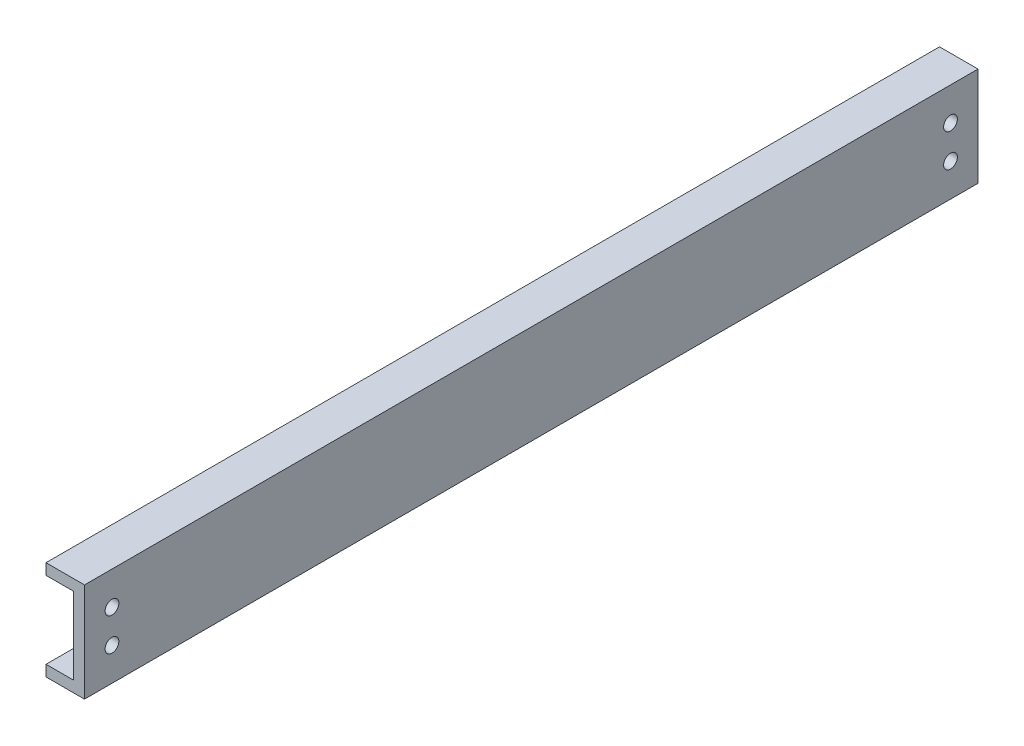
ISO-10303-21;
HEADER;
FILE_DESCRIPTION(('STEP AP214'),'2;1');
FILE_NAME('part.step','',(''),(''),'','','');
FILE_SCHEMA(('AUTOMOTIVE_DESIGN { 1 0 10303 214 1 1 1 1 }'));
ENDSEC;
DATA;
#1=APPLICATION_CONTEXT('core data for automotive mechanical design processes');
#2=APPLICATION_PROTOCOL_DEFINITION('international standard','automotive_design',2000,#1);
#3=PRODUCT_CONTEXT('',#1,'mechanical');
#4=PRODUCT('Part','Part','',(#3));
#5=PRODUCT_RELATED_PRODUCT_CATEGORY('part','',(#4));
#6=PRODUCT_DEFINITION_FORMATION('','',#4);
#7=PRODUCT_DEFINITION_CONTEXT('part definition',#1,'design');
#8=PRODUCT_DEFINITION('design','',#6,#7);
#9=PRODUCT_DEFINITION_SHAPE('','',#8);
#10=(LENGTH_UNIT() NAMED_UNIT(*) SI_UNIT(.MILLI.,.METRE.));
#11=(NAMED_UNIT(*) PLANE_ANGLE_UNIT() SI_UNIT($,.RADIAN.));
#12=(NAMED_UNIT(*) SI_UNIT($,.STERADIAN.) SOLID_ANGLE_UNIT());
#13=UNCERTAINTY_MEASURE_WITH_UNIT(LENGTH_MEASURE(1.E-05),#10,'distance_accuracy_value','');
#14=(GEOMETRIC_REPRESENTATION_CONTEXT(3) GLOBAL_UNCERTAINTY_ASSIGNED_CONTEXT((#13)) GLOBAL_UNIT_ASSIGNED_CONTEXT((#10,
#11,#12)) REPRESENTATION_CONTEXT('',''));
#15=CARTESIAN_POINT('',(0.,0.,0.));
#16=DIRECTION('',(0.,0.,1.));
#17=DIRECTION('',(1.,0.,0.));
#18=AXIS2_PLACEMENT_3D('',#15,#16,#17);
#19=CARTESIAN_POINT('',(-7.,9.88828278471343,-162.5));
#20=DIRECTION('',(-1.,0.,0.));
#21=DIRECTION('',(0.,0.,1.));
#22=AXIS2_PLACEMENT_3D('',#19,#20,#21);
#23=PLANE('',#22);
#24=DIRECTION('',(0.,-1.,0.));
#25=VECTOR('',#24,1.);
#26=CARTESIAN_POINT('',(-7.,9.88828278471343,0.));
#27=LINE('',#26,#25);
#28=CARTESIAN_POINT('',(-7.,9.88828278471343,0.));
#29=VERTEX_POINT('',#28);
#30=CARTESIAN_POINT('',(-7.,7.88828278471343,0.));
#31=VERTEX_POINT('',#30);
#32=EDGE_CURVE('E132',#29,#31,#27,.T.);
#33=ORIENTED_EDGE('',*,*,#32,.F.);
#34=DIRECTION('',(0.,0.,1.));
#35=VECTOR('',#34,1.);
#36=CARTESIAN_POINT('',(-7.,9.88828278471343,-162.5));
#37=LINE('',#36,#35);
#38=CARTESIAN_POINT('',(-7.,9.88828278471343,-162.5));
#39=VERTEX_POINT('',#38);
#40=EDGE_CURVE('E11',#39,#29,#37,.T.);
#41=ORIENTED_EDGE('',*,*,#40,.F.);
#42=DIRECTION('',(0.,-1.,0.));
#43=VECTOR('',#42,1.);
#44=CARTESIAN_POINT('',(-7.,9.88828278471343,-162.5));
#45=LINE('',#44,#43);
#46=CARTESIAN_POINT('',(-7.,7.88828278471343,-162.5));
#47=VERTEX_POINT('',#46);
#48=EDGE_CURVE('E152',#39,#47,#45,.T.);
#49=ORIENTED_EDGE('',*,*,#48,.T.);
#50=DIRECTION('',(0.,0.,1.));
#51=VECTOR('',#50,1.);
#52=CARTESIAN_POINT('',(-7.,7.88828278471343,-162.5));
#53=LINE('',#52,#51);
#54=EDGE_CURVE('E90',#47,#31,#53,.T.);
#55=ORIENTED_EDGE('',*,*,#54,.T.);
#56=EDGE_LOOP('',(#33,#41,#49,#55));
#57=FACE_BOUND('',#56,.T.);
#58=ADVANCED_FACE('F34',(#57),#23,.T.);
#59=CARTESIAN_POINT('',(-7.,9.88828278471343,-162.5));
#60=DIRECTION('',(0.,1.,0.));
#61=DIRECTION('',(-1.,0.,0.));
#62=AXIS2_PLACEMENT_3D('',#59,#60,#61);
#63=PLANE('',#62);
#64=DIRECTION('',(-1.,0.,0.));
#65=VECTOR('',#64,1.);
#66=CARTESIAN_POINT('',(-7.,9.88828278471343,0.));
#67=LINE('',#66,#65);
#68=CARTESIAN_POINT('',(0.,9.88828278471343,0.));
#69=VERTEX_POINT('',#68);
#70=EDGE_CURVE('E150',#69,#29,#67,.T.);
#71=ORIENTED_EDGE('',*,*,#70,.F.);
#72=DIRECTION('',(0.,0.,1.));
#73=VECTOR('',#72,1.);
#74=CARTESIAN_POINT('',(0.,9.88828278471343,-162.5));
#75=LINE('',#74,#73);
#76=CARTESIAN_POINT('',(0.,9.88828278471343,-162.5));
#77=VERTEX_POINT('',#76);
#78=EDGE_CURVE('E43',#77,#69,#75,.T.);
#79=ORIENTED_EDGE('',*,*,#78,.F.);
#80=DIRECTION('',(-1.,0.,0.));
#81=VECTOR('',#80,1.);
#82=CARTESIAN_POINT('',(-7.,9.88828278471343,-162.5));
#83=LINE('',#82,#81);
#84=EDGE_CURVE('E122',#77,#39,#83,.T.);
#85=ORIENTED_EDGE('',*,*,#84,.T.);
#86=ORIENTED_EDGE('',*,*,#40,.T.);
#87=EDGE_LOOP('',(#71,#79,#85,#86));
#88=FACE_BOUND('',#87,.T.);
#89=ADVANCED_FACE('F208',(#88),#63,.T.);
#90=CARTESIAN_POINT('',(0.,9.88828278471343,-162.5));
#91=DIRECTION('',(1.,0.,0.));
#92=DIRECTION('',(0.,1.,0.));
#93=AXIS2_PLACEMENT_3D('',#90,#91,#92);
#94=PLANE('',#93);
#95=CARTESIAN_POINT('',(0.,3.88828278471345,-157.5));
#96=DIRECTION('',(1.,0.,0.));
#97=DIRECTION('',(0.,-1.,0.));
#98=AXIS2_PLACEMENT_3D('',#95,#96,#97);
#99=CIRCLE('',#98,1.25000000000004);
#100=CARTESIAN_POINT('',(0.,2.63828278471341,-157.5));
#101=VERTEX_POINT('',#100);
#102=EDGE_CURVE('E258',#101,#101,#99,.T.);
#103=ORIENTED_EDGE('',*,*,#102,.F.);
#104=EDGE_LOOP('',(#103));
#105=FACE_BOUND('',#104,.T.);
#106=CARTESIAN_POINT('',(0.,-2.11171721528655,-157.5));
#107=DIRECTION('',(1.,0.,0.));
#108=DIRECTION('',(0.,1.,0.));
#109=AXIS2_PLACEMENT_3D('',#106,#107,#108);
#110=CIRCLE('',#109,1.25000000000004);
#111=CARTESIAN_POINT('',(0.,-0.861717215286511,-157.5));
#112=VERTEX_POINT('',#111);
#113=EDGE_CURVE('E254',#112,#112,#110,.T.);
#114=ORIENTED_EDGE('',*,*,#113,.F.);
#115=EDGE_LOOP('',(#114));
#116=FACE_BOUND('',#115,.T.);
#117=CARTESIAN_POINT('',(0.,-2.11171721528657,-5.));
#118=DIRECTION('',(1.,0.,0.));
#119=DIRECTION('',(0.,-1.,0.));
#120=AXIS2_PLACEMENT_3D('',#117,#118,#119);
#121=CIRCLE('',#120,1.25);
#122=CARTESIAN_POINT('',(0.,-3.36171721528657,-5.));
#123=VERTEX_POINT('',#122);
#124=EDGE_CURVE('E252',#123,#123,#121,.T.);
#125=ORIENTED_EDGE('',*,*,#124,.F.);
#126=EDGE_LOOP('',(#125));
#127=FACE_BOUND('',#126,.T.);
#128=CARTESIAN_POINT('',(0.,3.88828278471343,-5.));
#129=DIRECTION('',(1.,0.,0.));
#130=DIRECTION('',(0.,1.,0.));
#131=AXIS2_PLACEMENT_3D('',#128,#129,#130);
#132=CIRCLE('',#131,1.25);
#133=CARTESIAN_POINT('',(0.,5.13828278471343,-5.));
#134=VERTEX_POINT('',#133);
#135=EDGE_CURVE('E167',#134,#134,#132,.T.);
#136=ORIENTED_EDGE('',*,*,#135,.F.);
#137=EDGE_LOOP('',(#136));
#138=FACE_BOUND('',#137,.T.);
#139=DIRECTION('',(0.,1.,0.));
#140=VECTOR('',#139,1.);
#141=CARTESIAN_POINT('',(0.,9.88828278471343,0.));
#142=LINE('',#141,#140);
#143=CARTESIAN_POINT('',(0.,-8.11171721528657,0.));
#144=VERTEX_POINT('',#143);
#145=EDGE_CURVE('E109',#144,#69,#142,.T.);
#146=ORIENTED_EDGE('',*,*,#145,.F.);
#147=DIRECTION('',(0.,0.,1.));
#148=VECTOR('',#147,1.);
#149=CARTESIAN_POINT('',(0.,-8.11171721528657,-162.5));
#150=LINE('',#149,#148);
#151=CARTESIAN_POINT('',(0.,-8.11171721528657,-162.5));
#152=VERTEX_POINT('',#151);
#153=EDGE_CURVE('E104',#152,#144,#150,.T.);
#154=ORIENTED_EDGE('',*,*,#153,.F.);
#155=DIRECTION('',(0.,1.,0.));
#156=VECTOR('',#155,1.);
#157=CARTESIAN_POINT('',(0.,9.88828278471343,-162.5));
#158=LINE('',#157,#156);
#159=EDGE_CURVE('E107',#152,#77,#158,.T.);
#160=ORIENTED_EDGE('',*,*,#159,.T.);
#161=ORIENTED_EDGE('',*,*,#78,.T.);
#162=EDGE_LOOP('',(#146,#154,#160,#161));
#163=FACE_BOUND('',#162,.T.);
#164=ADVANCED_FACE('F106',(#105,#116,#127,#138,#163),#94,.T.);
#165=CARTESIAN_POINT('',(0.,-8.11171721528657,-162.5));
#166=DIRECTION('',(0.,-1.,0.));
#167=DIRECTION('',(1.,0.,0.));
#168=AXIS2_PLACEMENT_3D('',#165,#166,#167);
#169=PLANE('',#168);
#170=DIRECTION('',(1.,0.,0.));
#171=VECTOR('',#170,1.);
#172=CARTESIAN_POINT('',(0.,-8.11171721528657,0.));
#173=LINE('',#172,#171);
#174=CARTESIAN_POINT('',(-7.,-8.11171721528657,0.));
#175=VERTEX_POINT('',#174);
#176=EDGE_CURVE('E147',#175,#144,#173,.T.);
#177=ORIENTED_EDGE('',*,*,#176,.F.);
#178=DIRECTION('',(0.,0.,1.));
#179=VECTOR('',#178,1.);
#180=CARTESIAN_POINT('',(-7.,-8.11171721528657,-162.5));
#181=LINE('',#180,#179);
#182=CARTESIAN_POINT('',(-7.,-8.11171721528657,-162.5));
#183=VERTEX_POINT('',#182);
#184=EDGE_CURVE('E114',#183,#175,#181,.T.);
#185=ORIENTED_EDGE('',*,*,#184,.F.);
#186=DIRECTION('',(1.,0.,0.));
#187=VECTOR('',#186,1.);
#188=CARTESIAN_POINT('',(0.,-8.11171721528657,-162.5));
#189=LINE('',#188,#187);
#190=EDGE_CURVE('E120',#183,#152,#189,.T.);
#191=ORIENTED_EDGE('',*,*,#190,.T.);
#192=ORIENTED_EDGE('',*,*,#153,.T.);
#193=EDGE_LOOP('',(#177,#185,#191,#192));
#194=FACE_BOUND('',#193,.T.);
#195=ADVANCED_FACE('F124',(#194),#169,.T.);
#196=CARTESIAN_POINT('',(-7.,-8.11171721528657,-162.5));
#197=DIRECTION('',(-1.,0.,0.));
#198=DIRECTION('',(0.,0.,1.));
#199=AXIS2_PLACEMENT_3D('',#196,#197,#198);
#200=PLANE('',#199);
#201=DIRECTION('',(0.,-1.,0.));
#202=VECTOR('',#201,1.);
#203=CARTESIAN_POINT('',(-7.,-8.11171721528657,0.));
#204=LINE('',#203,#202);
#205=CARTESIAN_POINT('',(-7.,-6.11171721528657,0.));
#206=VERTEX_POINT('',#205);
#207=EDGE_CURVE('E144',#206,#175,#204,.T.);
#208=ORIENTED_EDGE('',*,*,#207,.F.);
#209=DIRECTION('',(0.,0.,1.));
#210=VECTOR('',#209,1.);
#211=CARTESIAN_POINT('',(-7.,-6.11171721528657,-162.5));
#212=LINE('',#211,#210);
#213=CARTESIAN_POINT('',(-7.,-6.11171721528657,-162.5));
#214=VERTEX_POINT('',#213);
#215=EDGE_CURVE('E156',#214,#206,#212,.T.);
#216=ORIENTED_EDGE('',*,*,#215,.F.);
#217=DIRECTION('',(0.,-1.,0.));
#218=VECTOR('',#217,1.);
#219=CARTESIAN_POINT('',(-7.,-8.11171721528657,-162.5));
#220=LINE('',#219,#218);
#221=EDGE_CURVE('E125',#214,#183,#220,.T.);
#222=ORIENTED_EDGE('',*,*,#221,.T.);
#223=ORIENTED_EDGE('',*,*,#184,.T.);
#224=EDGE_LOOP('',(#208,#216,#222,#223));
#225=FACE_BOUND('',#224,.T.);
#226=ADVANCED_FACE('F207',(#225),#200,.T.);
#227=CARTESIAN_POINT('',(-2.,-6.11171721528657,-162.5));
#228=DIRECTION('',(0.,1.,0.));
#229=DIRECTION('',(0.,0.,1.));
#230=AXIS2_PLACEMENT_3D('',#227,#228,#229);
#231=PLANE('',#230);
#232=DIRECTION('',(-1.,0.,0.));
#233=VECTOR('',#232,1.);
#234=CARTESIAN_POINT('',(-2.,-6.11171721528657,0.));
#235=LINE('',#234,#233);
#236=CARTESIAN_POINT('',(-2.,-6.11171721528657,0.));
#237=VERTEX_POINT('',#236);
#238=EDGE_CURVE('E141',#237,#206,#235,.T.);
#239=ORIENTED_EDGE('',*,*,#238,.F.);
#240=DIRECTION('',(0.,0.,1.));
#241=VECTOR('',#240,1.);
#242=CARTESIAN_POINT('',(-2.,-6.11171721528657,-162.5));
#243=LINE('',#242,#241);
#244=CARTESIAN_POINT('',(-2.,-6.11171721528657,-162.5));
#245=VERTEX_POINT('',#244);
#246=EDGE_CURVE('E158',#245,#237,#243,.T.);
#247=ORIENTED_EDGE('',*,*,#246,.F.);
#248=DIRECTION('',(-1.,0.,0.));
#249=VECTOR('',#248,1.);
#250=CARTESIAN_POINT('',(-2.,-6.11171721528657,-162.5));
#251=LINE('',#250,#249);
#252=EDGE_CURVE('E127',#245,#214,#251,.T.);
#253=ORIENTED_EDGE('',*,*,#252,.T.);
#254=ORIENTED_EDGE('',*,*,#215,.T.);
#255=EDGE_LOOP('',(#239,#247,#253,#254));
#256=FACE_BOUND('',#255,.T.);
#257=ADVANCED_FACE('F183',(#256),#231,.T.);
#258=CARTESIAN_POINT('',(-2.,7.88828278471343,-162.5));
#259=DIRECTION('',(-1.,0.,0.));
#260=DIRECTION('',(0.,-1.,0.));
#261=AXIS2_PLACEMENT_3D('',#258,#259,#260);
#262=PLANE('',#261);
#263=CARTESIAN_POINT('',(-2.,3.88828278471345,-157.5));
#264=DIRECTION('',(-1.,0.,0.));
#265=DIRECTION('',(0.,-1.,0.));
#266=AXIS2_PLACEMENT_3D('',#263,#264,#265);
#267=CIRCLE('',#266,1.25000000000004);
#268=CARTESIAN_POINT('',(-2.,2.63828278471341,-157.5));
#269=VERTEX_POINT('',#268);
#270=EDGE_CURVE('E37',#269,#269,#267,.T.);
#271=ORIENTED_EDGE('',*,*,#270,.F.);
#272=EDGE_LOOP('',(#271));
#273=FACE_BOUND('',#272,.T.);
#274=CARTESIAN_POINT('',(-2.,-2.11171721528655,-157.5));
#275=DIRECTION('',(-1.,0.,0.));
#276=DIRECTION('',(0.,-1.,0.));
#277=AXIS2_PLACEMENT_3D('',#274,#275,#276);
#278=CIRCLE('',#277,1.25000000000004);
#279=CARTESIAN_POINT('',(-2.,-3.36171721528659,-157.5));
#280=VERTEX_POINT('',#279);
#281=EDGE_CURVE('E169',#280,#280,#278,.T.);
#282=ORIENTED_EDGE('',*,*,#281,.F.);
#283=EDGE_LOOP('',(#282));
#284=FACE_BOUND('',#283,.T.);
#285=CARTESIAN_POINT('',(-2.,-2.11171721528657,-5.));
#286=DIRECTION('',(-1.,0.,0.));
#287=DIRECTION('',(0.,-1.,0.));
#288=AXIS2_PLACEMENT_3D('',#285,#286,#287);
#289=CIRCLE('',#288,1.25);
#290=CARTESIAN_POINT('',(-2.,-3.36171721528657,-5.));
#291=VERTEX_POINT('',#290);
#292=EDGE_CURVE('E166',#291,#291,#289,.T.);
#293=ORIENTED_EDGE('',*,*,#292,.F.);
#294=EDGE_LOOP('',(#293));
#295=FACE_BOUND('',#294,.T.);
#296=CARTESIAN_POINT('',(-2.,3.88828278471343,-5.));
#297=DIRECTION('',(-1.,0.,0.));
#298=DIRECTION('',(0.,-1.,0.));
#299=AXIS2_PLACEMENT_3D('',#296,#297,#298);
#300=CIRCLE('',#299,1.25);
#301=CARTESIAN_POINT('',(-2.,2.63828278471343,-5.));
#302=VERTEX_POINT('',#301);
#303=EDGE_CURVE('E163',#302,#302,#300,.T.);
#304=ORIENTED_EDGE('',*,*,#303,.F.);
#305=EDGE_LOOP('',(#304));
#306=FACE_BOUND('',#305,.T.);
#307=DIRECTION('',(0.,-1.,0.));
#308=VECTOR('',#307,1.);
#309=CARTESIAN_POINT('',(-2.,7.88828278471343,0.));
#310=LINE('',#309,#308);
#311=CARTESIAN_POINT('',(-2.,7.88828278471343,0.));
#312=VERTEX_POINT('',#311);
#313=EDGE_CURVE('E138',#312,#237,#310,.T.);
#314=ORIENTED_EDGE('',*,*,#313,.F.);
#315=DIRECTION('',(0.,0.,1.));
#316=VECTOR('',#315,1.);
#317=CARTESIAN_POINT('',(-2.,7.88828278471343,-162.5));
#318=LINE('',#317,#316);
#319=CARTESIAN_POINT('',(-2.,7.88828278471343,-162.5));
#320=VERTEX_POINT('',#319);
#321=EDGE_CURVE('E160',#320,#312,#318,.T.);
#322=ORIENTED_EDGE('',*,*,#321,.F.);
#323=DIRECTION('',(0.,-1.,0.));
#324=VECTOR('',#323,1.);
#325=CARTESIAN_POINT('',(-2.,7.88828278471343,-162.5));
#326=LINE('',#325,#324);
#327=EDGE_CURVE('E197',#320,#245,#326,.T.);
#328=ORIENTED_EDGE('',*,*,#327,.T.);
#329=ORIENTED_EDGE('',*,*,#246,.T.);
#330=EDGE_LOOP('',(#314,#322,#328,#329));
#331=FACE_BOUND('',#330,.T.);
#332=ADVANCED_FACE('F179',(#273,#284,#295,#306,#331),#262,.T.);
#333=CARTESIAN_POINT('',(-7.,7.88828278471343,-162.5));
#334=DIRECTION('',(0.,-1.,0.));
#335=DIRECTION('',(0.,0.,-1.));
#336=AXIS2_PLACEMENT_3D('',#333,#334,#335);
#337=PLANE('',#336);
#338=DIRECTION('',(1.,0.,0.));
#339=VECTOR('',#338,1.);
#340=CARTESIAN_POINT('',(-7.,7.88828278471343,0.));
#341=LINE('',#340,#339);
#342=EDGE_CURVE('E135',#31,#312,#341,.T.);
#343=ORIENTED_EDGE('',*,*,#342,.F.);
#344=ORIENTED_EDGE('',*,*,#54,.F.);
#345=DIRECTION('',(1.,0.,0.));
#346=VECTOR('',#345,1.);
#347=CARTESIAN_POINT('',(-7.,7.88828278471343,-162.5));
#348=LINE('',#347,#346);
#349=EDGE_CURVE('E196',#47,#320,#348,.T.);
#350=ORIENTED_EDGE('',*,*,#349,.T.);
#351=ORIENTED_EDGE('',*,*,#321,.T.);
#352=EDGE_LOOP('',(#343,#344,#350,#351));
#353=FACE_BOUND('',#352,.T.);
#354=ADVANCED_FACE('F182',(#353),#337,.T.);
#355=CARTESIAN_POINT('',(0.,0.,-162.5));
#356=DIRECTION('',(0.,0.,1.));
#357=DIRECTION('',(1.,0.,0.));
#358=AXIS2_PLACEMENT_3D('',#355,#356,#357);
#359=PLANE('',#358);
#360=ORIENTED_EDGE('',*,*,#48,.F.);
#361=ORIENTED_EDGE('',*,*,#84,.F.);
#362=ORIENTED_EDGE('',*,*,#159,.F.);
#363=ORIENTED_EDGE('',*,*,#190,.F.);
#364=ORIENTED_EDGE('',*,*,#221,.F.);
#365=ORIENTED_EDGE('',*,*,#252,.F.);
#366=ORIENTED_EDGE('',*,*,#327,.F.);
#367=ORIENTED_EDGE('',*,*,#349,.F.);
#368=EDGE_LOOP('',(#360,#361,#362,#363,#364,#365,#366,#367));
#369=FACE_BOUND('',#368,.T.);
#370=ADVANCED_FACE('F118',(#369),#359,.F.);
#371=CARTESIAN_POINT('',(0.,0.,0.));
#372=DIRECTION('',(0.,0.,1.));
#373=DIRECTION('',(1.,0.,0.));
#374=AXIS2_PLACEMENT_3D('',#371,#372,#373);
#375=PLANE('',#374);
#376=ORIENTED_EDGE('',*,*,#32,.T.);
#377=ORIENTED_EDGE('',*,*,#342,.T.);
#378=ORIENTED_EDGE('',*,*,#313,.T.);
#379=ORIENTED_EDGE('',*,*,#238,.T.);
#380=ORIENTED_EDGE('',*,*,#207,.T.);
#381=ORIENTED_EDGE('',*,*,#176,.T.);
#382=ORIENTED_EDGE('',*,*,#145,.T.);
#383=ORIENTED_EDGE('',*,*,#70,.T.);
#384=EDGE_LOOP('',(#376,#377,#378,#379,#380,#381,#382,#383));
#385=FACE_BOUND('',#384,.T.);
#386=ADVANCED_FACE('F195',(#385),#375,.T.);
#387=CARTESIAN_POINT('',(-7.,3.88828278471343,-5.));
#388=DIRECTION('',(1.,0.,0.));
#389=DIRECTION('',(0.,1.,0.));
#390=AXIS2_PLACEMENT_3D('',#387,#388,#389);
#391=CYLINDRICAL_SURFACE('',#390,1.25);
#392=ORIENTED_EDGE('',*,*,#303,.T.);
#393=EDGE_LOOP('',(#392));
#394=FACE_BOUND('',#393,.T.);
#395=ORIENTED_EDGE('',*,*,#135,.T.);
#396=EDGE_LOOP('',(#395));
#397=FACE_BOUND('',#396,.T.);
#398=ADVANCED_FACE('F234',(#394,#397),#391,.F.);
#399=CARTESIAN_POINT('',(-7.,-2.11171721528657,-5.));
#400=DIRECTION('',(1.,0.,0.));
#401=DIRECTION('',(0.,1.,0.));
#402=AXIS2_PLACEMENT_3D('',#399,#400,#401);
#403=CYLINDRICAL_SURFACE('',#402,1.25);
#404=ORIENTED_EDGE('',*,*,#292,.T.);
#405=EDGE_LOOP('',(#404));
#406=FACE_BOUND('',#405,.T.);
#407=ORIENTED_EDGE('',*,*,#124,.T.);
#408=EDGE_LOOP('',(#407));
#409=FACE_BOUND('',#408,.T.);
#410=ADVANCED_FACE('F238',(#406,#409),#403,.F.);
#411=CARTESIAN_POINT('',(-7.,-2.11171721528655,-157.5));
#412=DIRECTION('',(1.,0.,0.));
#413=DIRECTION('',(0.,1.,0.));
#414=AXIS2_PLACEMENT_3D('',#411,#412,#413);
#415=CYLINDRICAL_SURFACE('',#414,1.25000000000004);
#416=ORIENTED_EDGE('',*,*,#281,.T.);
#417=EDGE_LOOP('',(#416));
#418=FACE_BOUND('',#417,.T.);
#419=ORIENTED_EDGE('',*,*,#113,.T.);
#420=EDGE_LOOP('',(#419));
#421=FACE_BOUND('',#420,.T.);
#422=ADVANCED_FACE('F242',(#418,#421),#415,.F.);
#423=CARTESIAN_POINT('',(-7.,3.88828278471345,-157.5));
#424=DIRECTION('',(1.,0.,0.));
#425=DIRECTION('',(0.,1.,0.));
#426=AXIS2_PLACEMENT_3D('',#423,#424,#425);
#427=CYLINDRICAL_SURFACE('',#426,1.25000000000004);
#428=ORIENTED_EDGE('',*,*,#270,.T.);
#429=EDGE_LOOP('',(#428));
#430=FACE_BOUND('',#429,.T.);
#431=ORIENTED_EDGE('',*,*,#102,.T.);
#432=EDGE_LOOP('',(#431));
#433=FACE_BOUND('',#432,.T.);
#434=ADVANCED_FACE('F176',(#430,#433),#427,.F.);
#435=CLOSED_SHELL('',(#58,#89,#164,#195,#226,#257,#332,#354,#370,#386,#398,#410,#422,#434));
#436=MANIFOLD_SOLID_BREP('B2',#435);
#437=ADVANCED_BREP_SHAPE_REPRESENTATION('',(#18,#436),#14);
#438=SHAPE_DEFINITION_REPRESENTATION(#9,#437);
ENDSEC;
END-ISO-10303-21;
